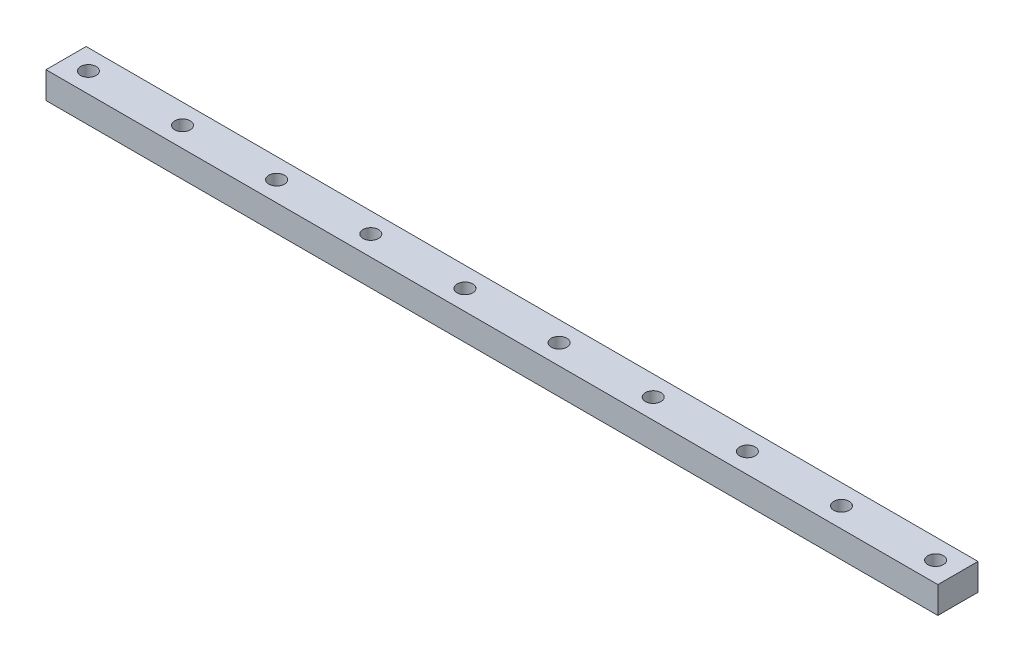
ISO-10303-21;
HEADER;
FILE_DESCRIPTION(('STEP AP214'),'2;1');
FILE_NAME('part.step','',(''),(''),'','','');
FILE_SCHEMA(('AUTOMOTIVE_DESIGN { 1 0 10303 214 1 1 1 1 }'));
ENDSEC;
DATA;
#1=APPLICATION_CONTEXT('core data for automotive mechanical design processes');
#2=APPLICATION_PROTOCOL_DEFINITION('international standard','automotive_design',2000,#1);
#3=PRODUCT_CONTEXT('',#1,'mechanical');
#4=PRODUCT('Part','Part','',(#3));
#5=PRODUCT_RELATED_PRODUCT_CATEGORY('part','',(#4));
#6=PRODUCT_DEFINITION_FORMATION('','',#4);
#7=PRODUCT_DEFINITION_CONTEXT('part definition',#1,'design');
#8=PRODUCT_DEFINITION('design','',#6,#7);
#9=PRODUCT_DEFINITION_SHAPE('','',#8);
#10=(LENGTH_UNIT() NAMED_UNIT(*) SI_UNIT(.MILLI.,.METRE.));
#11=(NAMED_UNIT(*) PLANE_ANGLE_UNIT() SI_UNIT($,.RADIAN.));
#12=(NAMED_UNIT(*) SI_UNIT($,.STERADIAN.) SOLID_ANGLE_UNIT());
#13=UNCERTAINTY_MEASURE_WITH_UNIT(LENGTH_MEASURE(1.E-05),#10,'distance_accuracy_value','');
#14=(GEOMETRIC_REPRESENTATION_CONTEXT(3) GLOBAL_UNCERTAINTY_ASSIGNED_CONTEXT((#13)) GLOBAL_UNIT_ASSIGNED_CONTEXT((#10,
#11,#12)) REPRESENTATION_CONTEXT('',''));
#15=CARTESIAN_POINT('',(0.,0.,0.));
#16=DIRECTION('',(0.,0.,1.));
#17=DIRECTION('',(1.,0.,0.));
#18=AXIS2_PLACEMENT_3D('',#15,#16,#17);
#19=CARTESIAN_POINT('',(195.,0.,-4.5));
#20=DIRECTION('',(0.,1.,0.));
#21=DIRECTION('',(0.,0.,1.));
#22=AXIS2_PLACEMENT_3D('',#19,#20,#21);
#23=CYLINDRICAL_SURFACE('',#22,1.75);
#24=CARTESIAN_POINT('',(195.,0.,-4.5));
#25=DIRECTION('',(0.,1.,0.));
#26=DIRECTION('',(0.,0.,1.));
#27=AXIS2_PLACEMENT_3D('',#24,#25,#26);
#28=CIRCLE('',#27,1.75);
#29=CARTESIAN_POINT('',(195.,0.,-2.75));
#30=VERTEX_POINT('',#29);
#31=EDGE_CURVE('E42',#30,#30,#28,.T.);
#32=ORIENTED_EDGE('',*,*,#31,.F.);
#33=EDGE_LOOP('',(#32));
#34=FACE_BOUND('',#33,.T.);
#35=CARTESIAN_POINT('',(195.,6.,-4.5));
#36=DIRECTION('',(0.,1.,0.));
#37=DIRECTION('',(0.,0.,1.));
#38=AXIS2_PLACEMENT_3D('',#35,#36,#37);
#39=CIRCLE('',#38,1.75);
#40=CARTESIAN_POINT('',(195.,6.,-2.75));
#41=VERTEX_POINT('',#40);
#42=EDGE_CURVE('E11',#41,#41,#39,.T.);
#43=ORIENTED_EDGE('',*,*,#42,.T.);
#44=EDGE_LOOP('',(#43));
#45=FACE_BOUND('',#44,.T.);
#46=ADVANCED_FACE('F34',(#34,#45),#23,.F.);
#47=CARTESIAN_POINT('',(173.888888888889,0.,-4.5));
#48=DIRECTION('',(0.,1.,0.));
#49=DIRECTION('',(0.,0.,1.));
#50=AXIS2_PLACEMENT_3D('',#47,#48,#49);
#51=CYLINDRICAL_SURFACE('',#50,1.75);
#52=CARTESIAN_POINT('',(173.888888888889,0.,-4.5));
#53=DIRECTION('',(0.,1.,0.));
#54=DIRECTION('',(0.,0.,1.));
#55=AXIS2_PLACEMENT_3D('',#52,#53,#54);
#56=CIRCLE('',#55,1.75);
#57=CARTESIAN_POINT('',(173.888888888889,0.,-2.75));
#58=VERTEX_POINT('',#57);
#59=EDGE_CURVE('E148',#58,#58,#56,.T.);
#60=ORIENTED_EDGE('',*,*,#59,.F.);
#61=EDGE_LOOP('',(#60));
#62=FACE_BOUND('',#61,.T.);
#63=CARTESIAN_POINT('',(173.888888888889,6.,-4.5));
#64=DIRECTION('',(0.,1.,0.));
#65=DIRECTION('',(0.,0.,1.));
#66=AXIS2_PLACEMENT_3D('',#63,#64,#65);
#67=CIRCLE('',#66,1.75);
#68=CARTESIAN_POINT('',(173.888888888889,6.,-2.75));
#69=VERTEX_POINT('',#68);
#70=EDGE_CURVE('E151',#69,#69,#67,.T.);
#71=ORIENTED_EDGE('',*,*,#70,.T.);
#72=EDGE_LOOP('',(#71));
#73=FACE_BOUND('',#72,.T.);
#74=ADVANCED_FACE('F160',(#62,#73),#51,.F.);
#75=CARTESIAN_POINT('',(152.777777777778,0.,-4.5));
#76=DIRECTION('',(0.,1.,0.));
#77=DIRECTION('',(0.,0.,1.));
#78=AXIS2_PLACEMENT_3D('',#75,#76,#77);
#79=CYLINDRICAL_SURFACE('',#78,1.75);
#80=CARTESIAN_POINT('',(152.777777777778,0.,-4.5));
#81=DIRECTION('',(0.,1.,0.));
#82=DIRECTION('',(0.,0.,1.));
#83=AXIS2_PLACEMENT_3D('',#80,#81,#82);
#84=CIRCLE('',#83,1.75);
#85=CARTESIAN_POINT('',(152.777777777778,0.,-2.75));
#86=VERTEX_POINT('',#85);
#87=EDGE_CURVE('E142',#86,#86,#84,.T.);
#88=ORIENTED_EDGE('',*,*,#87,.F.);
#89=EDGE_LOOP('',(#88));
#90=FACE_BOUND('',#89,.T.);
#91=CARTESIAN_POINT('',(152.777777777778,6.,-4.5));
#92=DIRECTION('',(0.,1.,0.));
#93=DIRECTION('',(0.,0.,1.));
#94=AXIS2_PLACEMENT_3D('',#91,#92,#93);
#95=CIRCLE('',#94,1.75);
#96=CARTESIAN_POINT('',(152.777777777778,6.,-2.75));
#97=VERTEX_POINT('',#96);
#98=EDGE_CURVE('E145',#97,#97,#95,.T.);
#99=ORIENTED_EDGE('',*,*,#98,.T.);
#100=EDGE_LOOP('',(#99));
#101=FACE_BOUND('',#100,.T.);
#102=ADVANCED_FACE('F207',(#90,#101),#79,.F.);
#103=CARTESIAN_POINT('',(131.666666666667,0.,-4.5));
#104=DIRECTION('',(0.,1.,0.));
#105=DIRECTION('',(0.,0.,1.));
#106=AXIS2_PLACEMENT_3D('',#103,#104,#105);
#107=CYLINDRICAL_SURFACE('',#106,1.75);
#108=CARTESIAN_POINT('',(131.666666666667,0.,-4.5));
#109=DIRECTION('',(0.,1.,0.));
#110=DIRECTION('',(0.,0.,1.));
#111=AXIS2_PLACEMENT_3D('',#108,#109,#110);
#112=CIRCLE('',#111,1.75);
#113=CARTESIAN_POINT('',(131.666666666667,0.,-2.75));
#114=VERTEX_POINT('',#113);
#115=EDGE_CURVE('E136',#114,#114,#112,.T.);
#116=ORIENTED_EDGE('',*,*,#115,.F.);
#117=EDGE_LOOP('',(#116));
#118=FACE_BOUND('',#117,.T.);
#119=CARTESIAN_POINT('',(131.666666666667,6.,-4.5));
#120=DIRECTION('',(0.,1.,0.));
#121=DIRECTION('',(0.,0.,1.));
#122=AXIS2_PLACEMENT_3D('',#119,#120,#121);
#123=CIRCLE('',#122,1.75);
#124=CARTESIAN_POINT('',(131.666666666667,6.,-2.75));
#125=VERTEX_POINT('',#124);
#126=EDGE_CURVE('E139',#125,#125,#123,.T.);
#127=ORIENTED_EDGE('',*,*,#126,.T.);
#128=EDGE_LOOP('',(#127));
#129=FACE_BOUND('',#128,.T.);
#130=ADVANCED_FACE('F203',(#118,#129),#107,.F.);
#131=CARTESIAN_POINT('',(110.555555555556,0.,-4.5));
#132=DIRECTION('',(0.,1.,0.));
#133=DIRECTION('',(0.,0.,1.));
#134=AXIS2_PLACEMENT_3D('',#131,#132,#133);
#135=CYLINDRICAL_SURFACE('',#134,1.75);
#136=CARTESIAN_POINT('',(110.555555555556,0.,-4.5));
#137=DIRECTION('',(0.,1.,0.));
#138=DIRECTION('',(0.,0.,1.));
#139=AXIS2_PLACEMENT_3D('',#136,#137,#138);
#140=CIRCLE('',#139,1.75);
#141=CARTESIAN_POINT('',(110.555555555556,0.,-2.75));
#142=VERTEX_POINT('',#141);
#143=EDGE_CURVE('E130',#142,#142,#140,.T.);
#144=ORIENTED_EDGE('',*,*,#143,.F.);
#145=EDGE_LOOP('',(#144));
#146=FACE_BOUND('',#145,.T.);
#147=CARTESIAN_POINT('',(110.555555555556,6.,-4.5));
#148=DIRECTION('',(0.,1.,0.));
#149=DIRECTION('',(0.,0.,1.));
#150=AXIS2_PLACEMENT_3D('',#147,#148,#149);
#151=CIRCLE('',#150,1.75);
#152=CARTESIAN_POINT('',(110.555555555556,6.,-2.75));
#153=VERTEX_POINT('',#152);
#154=EDGE_CURVE('E133',#153,#153,#151,.T.);
#155=ORIENTED_EDGE('',*,*,#154,.T.);
#156=EDGE_LOOP('',(#155));
#157=FACE_BOUND('',#156,.T.);
#158=ADVANCED_FACE('F199',(#146,#157),#135,.F.);
#159=CARTESIAN_POINT('',(89.4444444444445,0.,-4.5));
#160=DIRECTION('',(0.,1.,0.));
#161=DIRECTION('',(0.,0.,1.));
#162=AXIS2_PLACEMENT_3D('',#159,#160,#161);
#163=CYLINDRICAL_SURFACE('',#162,1.75);
#164=CARTESIAN_POINT('',(89.4444444444445,0.,-4.5));
#165=DIRECTION('',(0.,1.,0.));
#166=DIRECTION('',(0.,0.,1.));
#167=AXIS2_PLACEMENT_3D('',#164,#165,#166);
#168=CIRCLE('',#167,1.75);
#169=CARTESIAN_POINT('',(89.4444444444445,0.,-2.75));
#170=VERTEX_POINT('',#169);
#171=EDGE_CURVE('E124',#170,#170,#168,.T.);
#172=ORIENTED_EDGE('',*,*,#171,.F.);
#173=EDGE_LOOP('',(#172));
#174=FACE_BOUND('',#173,.T.);
#175=CARTESIAN_POINT('',(89.4444444444445,6.,-4.5));
#176=DIRECTION('',(0.,1.,0.));
#177=DIRECTION('',(0.,0.,1.));
#178=AXIS2_PLACEMENT_3D('',#175,#176,#177);
#179=CIRCLE('',#178,1.75);
#180=CARTESIAN_POINT('',(89.4444444444445,6.,-2.75));
#181=VERTEX_POINT('',#180);
#182=EDGE_CURVE('E127',#181,#181,#179,.T.);
#183=ORIENTED_EDGE('',*,*,#182,.T.);
#184=EDGE_LOOP('',(#183));
#185=FACE_BOUND('',#184,.T.);
#186=ADVANCED_FACE('F195',(#174,#185),#163,.F.);
#187=CARTESIAN_POINT('',(68.3333333333333,0.,-4.5));
#188=DIRECTION('',(0.,1.,0.));
#189=DIRECTION('',(0.,0.,1.));
#190=AXIS2_PLACEMENT_3D('',#187,#188,#189);
#191=CYLINDRICAL_SURFACE('',#190,1.75);
#192=CARTESIAN_POINT('',(68.3333333333333,0.,-4.5));
#193=DIRECTION('',(0.,1.,0.));
#194=DIRECTION('',(0.,0.,1.));
#195=AXIS2_PLACEMENT_3D('',#192,#193,#194);
#196=CIRCLE('',#195,1.75);
#197=CARTESIAN_POINT('',(68.3333333333333,0.,-2.75));
#198=VERTEX_POINT('',#197);
#199=EDGE_CURVE('E118',#198,#198,#196,.T.);
#200=ORIENTED_EDGE('',*,*,#199,.F.);
#201=EDGE_LOOP('',(#200));
#202=FACE_BOUND('',#201,.T.);
#203=CARTESIAN_POINT('',(68.3333333333333,6.,-4.5));
#204=DIRECTION('',(0.,1.,0.));
#205=DIRECTION('',(0.,0.,1.));
#206=AXIS2_PLACEMENT_3D('',#203,#204,#205);
#207=CIRCLE('',#206,1.75);
#208=CARTESIAN_POINT('',(68.3333333333333,6.,-2.75));
#209=VERTEX_POINT('',#208);
#210=EDGE_CURVE('E121',#209,#209,#207,.T.);
#211=ORIENTED_EDGE('',*,*,#210,.T.);
#212=EDGE_LOOP('',(#211));
#213=FACE_BOUND('',#212,.T.);
#214=ADVANCED_FACE('F191',(#202,#213),#191,.F.);
#215=CARTESIAN_POINT('',(47.2222222222222,0.,-4.5));
#216=DIRECTION('',(0.,1.,0.));
#217=DIRECTION('',(0.,0.,1.));
#218=AXIS2_PLACEMENT_3D('',#215,#216,#217);
#219=CYLINDRICAL_SURFACE('',#218,1.75);
#220=CARTESIAN_POINT('',(47.2222222222222,0.,-4.5));
#221=DIRECTION('',(0.,1.,0.));
#222=DIRECTION('',(0.,0.,1.));
#223=AXIS2_PLACEMENT_3D('',#220,#221,#222);
#224=CIRCLE('',#223,1.75);
#225=CARTESIAN_POINT('',(47.2222222222222,0.,-2.75));
#226=VERTEX_POINT('',#225);
#227=EDGE_CURVE('E112',#226,#226,#224,.T.);
#228=ORIENTED_EDGE('',*,*,#227,.F.);
#229=EDGE_LOOP('',(#228));
#230=FACE_BOUND('',#229,.T.);
#231=CARTESIAN_POINT('',(47.2222222222222,6.,-4.5));
#232=DIRECTION('',(0.,1.,0.));
#233=DIRECTION('',(0.,0.,1.));
#234=AXIS2_PLACEMENT_3D('',#231,#232,#233);
#235=CIRCLE('',#234,1.75);
#236=CARTESIAN_POINT('',(47.2222222222222,6.,-2.75));
#237=VERTEX_POINT('',#236);
#238=EDGE_CURVE('E115',#237,#237,#235,.T.);
#239=ORIENTED_EDGE('',*,*,#238,.T.);
#240=EDGE_LOOP('',(#239));
#241=FACE_BOUND('',#240,.T.);
#242=ADVANCED_FACE('F187',(#230,#241),#219,.F.);
#243=CARTESIAN_POINT('',(0.,6.,0.));
#244=DIRECTION('',(1.,0.,0.));
#245=DIRECTION('',(0.,0.,-1.));
#246=AXIS2_PLACEMENT_3D('',#243,#244,#245);
#247=PLANE('',#246);
#248=DIRECTION('',(0.,0.,1.));
#249=VECTOR('',#248,1.);
#250=CARTESIAN_POINT('',(0.,0.,0.));
#251=LINE('',#250,#249);
#252=CARTESIAN_POINT('',(0.,0.,-9.));
#253=VERTEX_POINT('',#252);
#254=CARTESIAN_POINT('',(0.,0.,0.));
#255=VERTEX_POINT('',#254);
#256=EDGE_CURVE('E102',#253,#255,#251,.T.);
#257=ORIENTED_EDGE('',*,*,#256,.T.);
#258=DIRECTION('',(0.,-1.,0.));
#259=VECTOR('',#258,1.);
#260=CARTESIAN_POINT('',(0.,6.,0.));
#261=LINE('',#260,#259);
#262=CARTESIAN_POINT('',(0.,6.,0.));
#263=VERTEX_POINT('',#262);
#264=EDGE_CURVE('E93',#263,#255,#261,.T.);
#265=ORIENTED_EDGE('',*,*,#264,.F.);
#266=DIRECTION('',(0.,0.,1.));
#267=VECTOR('',#266,1.);
#268=CARTESIAN_POINT('',(0.,6.,0.));
#269=LINE('',#268,#267);
#270=CARTESIAN_POINT('',(0.,6.,-9.));
#271=VERTEX_POINT('',#270);
#272=EDGE_CURVE('E87',#271,#263,#269,.T.);
#273=ORIENTED_EDGE('',*,*,#272,.F.);
#274=DIRECTION('',(0.,-1.,0.));
#275=VECTOR('',#274,1.);
#276=CARTESIAN_POINT('',(0.,6.,-9.));
#277=LINE('',#276,#275);
#278=EDGE_CURVE('E98',#271,#253,#277,.T.);
#279=ORIENTED_EDGE('',*,*,#278,.T.);
#280=EDGE_LOOP('',(#257,#265,#273,#279));
#281=FACE_BOUND('',#280,.T.);
#282=ADVANCED_FACE('F184',(#281),#247,.F.);
#283=CARTESIAN_POINT('',(0.,6.,0.));
#284=DIRECTION('',(0.,0.,-1.));
#285=DIRECTION('',(-1.,0.,0.));
#286=AXIS2_PLACEMENT_3D('',#283,#284,#285);
#287=PLANE('',#286);
#288=DIRECTION('',(1.,0.,0.));
#289=VECTOR('',#288,1.);
#290=CARTESIAN_POINT('',(0.,0.,0.));
#291=LINE('',#290,#289);
#292=CARTESIAN_POINT('',(200.,0.,0.));
#293=VERTEX_POINT('',#292);
#294=EDGE_CURVE('E92',#255,#293,#291,.T.);
#295=ORIENTED_EDGE('',*,*,#294,.T.);
#296=DIRECTION('',(0.,-1.,0.));
#297=VECTOR('',#296,1.);
#298=CARTESIAN_POINT('',(200.,6.,0.));
#299=LINE('',#298,#297);
#300=CARTESIAN_POINT('',(200.,6.,0.));
#301=VERTEX_POINT('',#300);
#302=EDGE_CURVE('E90',#301,#293,#299,.T.);
#303=ORIENTED_EDGE('',*,*,#302,.F.);
#304=DIRECTION('',(1.,0.,0.));
#305=VECTOR('',#304,1.);
#306=CARTESIAN_POINT('',(0.,6.,0.));
#307=LINE('',#306,#305);
#308=EDGE_CURVE('E81',#263,#301,#307,.T.);
#309=ORIENTED_EDGE('',*,*,#308,.F.);
#310=ORIENTED_EDGE('',*,*,#264,.T.);
#311=EDGE_LOOP('',(#295,#303,#309,#310));
#312=FACE_BOUND('',#311,.T.);
#313=ADVANCED_FACE('F91',(#312),#287,.F.);
#314=CARTESIAN_POINT('',(200.,6.,0.));
#315=DIRECTION('',(-1.,0.,0.));
#316=DIRECTION('',(0.,0.,1.));
#317=AXIS2_PLACEMENT_3D('',#314,#315,#316);
#318=PLANE('',#317);
#319=DIRECTION('',(0.,0.,-1.));
#320=VECTOR('',#319,1.);
#321=CARTESIAN_POINT('',(200.,0.,0.));
#322=LINE('',#321,#320);
#323=CARTESIAN_POINT('',(200.,0.,-9.));
#324=VERTEX_POINT('',#323);
#325=EDGE_CURVE('E67',#293,#324,#322,.T.);
#326=ORIENTED_EDGE('',*,*,#325,.T.);
#327=DIRECTION('',(0.,-1.,0.));
#328=VECTOR('',#327,1.);
#329=CARTESIAN_POINT('',(200.,6.,-9.));
#330=LINE('',#329,#328);
#331=CARTESIAN_POINT('',(200.,6.,-9.));
#332=VERTEX_POINT('',#331);
#333=EDGE_CURVE('E94',#332,#324,#330,.T.);
#334=ORIENTED_EDGE('',*,*,#333,.F.);
#335=DIRECTION('',(0.,0.,-1.));
#336=VECTOR('',#335,1.);
#337=CARTESIAN_POINT('',(200.,6.,0.));
#338=LINE('',#337,#336);
#339=EDGE_CURVE('E85',#301,#332,#338,.T.);
#340=ORIENTED_EDGE('',*,*,#339,.F.);
#341=ORIENTED_EDGE('',*,*,#302,.T.);
#342=EDGE_LOOP('',(#326,#334,#340,#341));
#343=FACE_BOUND('',#342,.T.);
#344=ADVANCED_FACE('F96',(#343),#318,.F.);
#345=CARTESIAN_POINT('',(0.,6.,-9.));
#346=DIRECTION('',(0.,0.,1.));
#347=DIRECTION('',(1.,0.,0.));
#348=AXIS2_PLACEMENT_3D('',#345,#346,#347);
#349=PLANE('',#348);
#350=DIRECTION('',(-1.,0.,0.));
#351=VECTOR('',#350,1.);
#352=CARTESIAN_POINT('',(0.,0.,-9.));
#353=LINE('',#352,#351);
#354=EDGE_CURVE('E73',#324,#253,#353,.T.);
#355=ORIENTED_EDGE('',*,*,#354,.T.);
#356=ORIENTED_EDGE('',*,*,#278,.F.);
#357=DIRECTION('',(-1.,0.,0.));
#358=VECTOR('',#357,1.);
#359=CARTESIAN_POINT('',(0.,6.,-9.));
#360=LINE('',#359,#358);
#361=EDGE_CURVE('E50',#332,#271,#360,.T.);
#362=ORIENTED_EDGE('',*,*,#361,.F.);
#363=ORIENTED_EDGE('',*,*,#333,.T.);
#364=EDGE_LOOP('',(#355,#356,#362,#363));
#365=FACE_BOUND('',#364,.T.);
#366=ADVANCED_FACE('F164',(#365),#349,.F.);
#367=CARTESIAN_POINT('',(0.,6.,0.));
#368=DIRECTION('',(0.,-1.,0.));
#369=DIRECTION('',(0.,0.,-1.));
#370=AXIS2_PLACEMENT_3D('',#367,#368,#369);
#371=PLANE('',#370);
#372=CARTESIAN_POINT('',(26.1111111111111,6.,-4.5));
#373=DIRECTION('',(0.,1.,0.));
#374=DIRECTION('',(0.,0.,1.));
#375=AXIS2_PLACEMENT_3D('',#372,#373,#374);
#376=CIRCLE('',#375,1.75);
#377=CARTESIAN_POINT('',(26.1111111111111,6.,-2.75));
#378=VERTEX_POINT('',#377);
#379=EDGE_CURVE('E316',#378,#378,#376,.T.);
#380=ORIENTED_EDGE('',*,*,#379,.F.);
#381=EDGE_LOOP('',(#380));
#382=FACE_BOUND('',#381,.T.);
#383=CARTESIAN_POINT('',(5.,6.,-4.5));
#384=DIRECTION('',(0.,1.,0.));
#385=DIRECTION('',(0.,0.,1.));
#386=AXIS2_PLACEMENT_3D('',#383,#384,#385);
#387=CIRCLE('',#386,1.75);
#388=CARTESIAN_POINT('',(5.,6.,-2.75));
#389=VERTEX_POINT('',#388);
#390=EDGE_CURVE('E317',#389,#389,#387,.T.);
#391=ORIENTED_EDGE('',*,*,#390,.F.);
#392=EDGE_LOOP('',(#391));
#393=FACE_BOUND('',#392,.T.);
#394=ORIENTED_EDGE('',*,*,#272,.T.);
#395=ORIENTED_EDGE('',*,*,#308,.T.);
#396=ORIENTED_EDGE('',*,*,#339,.T.);
#397=ORIENTED_EDGE('',*,*,#361,.T.);
#398=EDGE_LOOP('',(#394,#395,#396,#397));
#399=FACE_BOUND('',#398,.T.);
#400=ORIENTED_EDGE('',*,*,#238,.F.);
#401=EDGE_LOOP('',(#400));
#402=FACE_BOUND('',#401,.T.);
#403=ORIENTED_EDGE('',*,*,#210,.F.);
#404=EDGE_LOOP('',(#403));
#405=FACE_BOUND('',#404,.T.);
#406=ORIENTED_EDGE('',*,*,#182,.F.);
#407=EDGE_LOOP('',(#406));
#408=FACE_BOUND('',#407,.T.);
#409=ORIENTED_EDGE('',*,*,#154,.F.);
#410=EDGE_LOOP('',(#409));
#411=FACE_BOUND('',#410,.T.);
#412=ORIENTED_EDGE('',*,*,#126,.F.);
#413=EDGE_LOOP('',(#412));
#414=FACE_BOUND('',#413,.T.);
#415=ORIENTED_EDGE('',*,*,#98,.F.);
#416=EDGE_LOOP('',(#415));
#417=FACE_BOUND('',#416,.T.);
#418=ORIENTED_EDGE('',*,*,#70,.F.);
#419=EDGE_LOOP('',(#418));
#420=FACE_BOUND('',#419,.T.);
#421=ORIENTED_EDGE('',*,*,#42,.F.);
#422=EDGE_LOOP('',(#421));
#423=FACE_BOUND('',#422,.T.);
#424=ADVANCED_FACE('F82',(#382,#393,#399,#402,#405,#408,#411,#414,#417,#420,#423),#371,.F.);
#425=CARTESIAN_POINT('',(0.,0.,0.));
#426=DIRECTION('',(0.,-1.,0.));
#427=DIRECTION('',(0.,0.,-1.));
#428=AXIS2_PLACEMENT_3D('',#425,#426,#427);
#429=PLANE('',#428);
#430=CARTESIAN_POINT('',(26.1111111111111,0.,-4.5));
#431=DIRECTION('',(0.,1.,0.));
#432=DIRECTION('',(0.,0.,1.));
#433=AXIS2_PLACEMENT_3D('',#430,#431,#432);
#434=CIRCLE('',#433,1.75);
#435=CARTESIAN_POINT('',(26.1111111111111,0.,-2.75));
#436=VERTEX_POINT('',#435);
#437=EDGE_CURVE('E314',#436,#436,#434,.T.);
#438=ORIENTED_EDGE('',*,*,#437,.T.);
#439=EDGE_LOOP('',(#438));
#440=FACE_BOUND('',#439,.T.);
#441=CARTESIAN_POINT('',(5.,0.,-4.5));
#442=DIRECTION('',(0.,1.,0.));
#443=DIRECTION('',(0.,0.,1.));
#444=AXIS2_PLACEMENT_3D('',#441,#442,#443);
#445=CIRCLE('',#444,1.75);
#446=CARTESIAN_POINT('',(5.,0.,-2.75));
#447=VERTEX_POINT('',#446);
#448=EDGE_CURVE('E105',#447,#447,#445,.T.);
#449=ORIENTED_EDGE('',*,*,#448,.T.);
#450=EDGE_LOOP('',(#449));
#451=FACE_BOUND('',#450,.T.);
#452=ORIENTED_EDGE('',*,*,#256,.F.);
#453=ORIENTED_EDGE('',*,*,#354,.F.);
#454=ORIENTED_EDGE('',*,*,#325,.F.);
#455=ORIENTED_EDGE('',*,*,#294,.F.);
#456=EDGE_LOOP('',(#452,#453,#454,#455));
#457=FACE_BOUND('',#456,.T.);
#458=ORIENTED_EDGE('',*,*,#227,.T.);
#459=EDGE_LOOP('',(#458));
#460=FACE_BOUND('',#459,.T.);
#461=ORIENTED_EDGE('',*,*,#199,.T.);
#462=EDGE_LOOP('',(#461));
#463=FACE_BOUND('',#462,.T.);
#464=ORIENTED_EDGE('',*,*,#171,.T.);
#465=EDGE_LOOP('',(#464));
#466=FACE_BOUND('',#465,.T.);
#467=ORIENTED_EDGE('',*,*,#143,.T.);
#468=EDGE_LOOP('',(#467));
#469=FACE_BOUND('',#468,.T.);
#470=ORIENTED_EDGE('',*,*,#115,.T.);
#471=EDGE_LOOP('',(#470));
#472=FACE_BOUND('',#471,.T.);
#473=ORIENTED_EDGE('',*,*,#87,.T.);
#474=EDGE_LOOP('',(#473));
#475=FACE_BOUND('',#474,.T.);
#476=ORIENTED_EDGE('',*,*,#59,.T.);
#477=EDGE_LOOP('',(#476));
#478=FACE_BOUND('',#477,.T.);
#479=ORIENTED_EDGE('',*,*,#31,.T.);
#480=EDGE_LOOP('',(#479));
#481=FACE_BOUND('',#480,.T.);
#482=ADVANCED_FACE('F156',(#440,#451,#457,#460,#463,#466,#469,#472,#475,#478,#481),#429,.T.);
#483=CARTESIAN_POINT('',(5.,0.,-4.5));
#484=DIRECTION('',(0.,1.,0.));
#485=DIRECTION('',(0.,0.,1.));
#486=AXIS2_PLACEMENT_3D('',#483,#484,#485);
#487=CYLINDRICAL_SURFACE('',#486,1.75);
#488=ORIENTED_EDGE('',*,*,#448,.F.);
#489=EDGE_LOOP('',(#488));
#490=FACE_BOUND('',#489,.T.);
#491=ORIENTED_EDGE('',*,*,#390,.T.);
#492=EDGE_LOOP('',(#491));
#493=FACE_BOUND('',#492,.T.);
#494=ADVANCED_FACE('F171',(#490,#493),#487,.F.);
#495=CARTESIAN_POINT('',(26.1111111111111,0.,-4.5));
#496=DIRECTION('',(0.,1.,0.));
#497=DIRECTION('',(0.,0.,1.));
#498=AXIS2_PLACEMENT_3D('',#495,#496,#497);
#499=CYLINDRICAL_SURFACE('',#498,1.75);
#500=ORIENTED_EDGE('',*,*,#437,.F.);
#501=EDGE_LOOP('',(#500));
#502=FACE_BOUND('',#501,.T.);
#503=ORIENTED_EDGE('',*,*,#379,.T.);
#504=EDGE_LOOP('',(#503));
#505=FACE_BOUND('',#504,.T.);
#506=ADVANCED_FACE('F271',(#502,#505),#499,.F.);
#507=CLOSED_SHELL('',(#46,#74,#102,#130,#158,#186,#214,#242,#282,#313,#344,#366,#424,#482,#494,#506));
#508=MANIFOLD_SOLID_BREP('B2',#507);
#509=ADVANCED_BREP_SHAPE_REPRESENTATION('',(#18,#508),#14);
#510=SHAPE_DEFINITION_REPRESENTATION(#9,#509);
ENDSEC;
END-ISO-10303-21;
